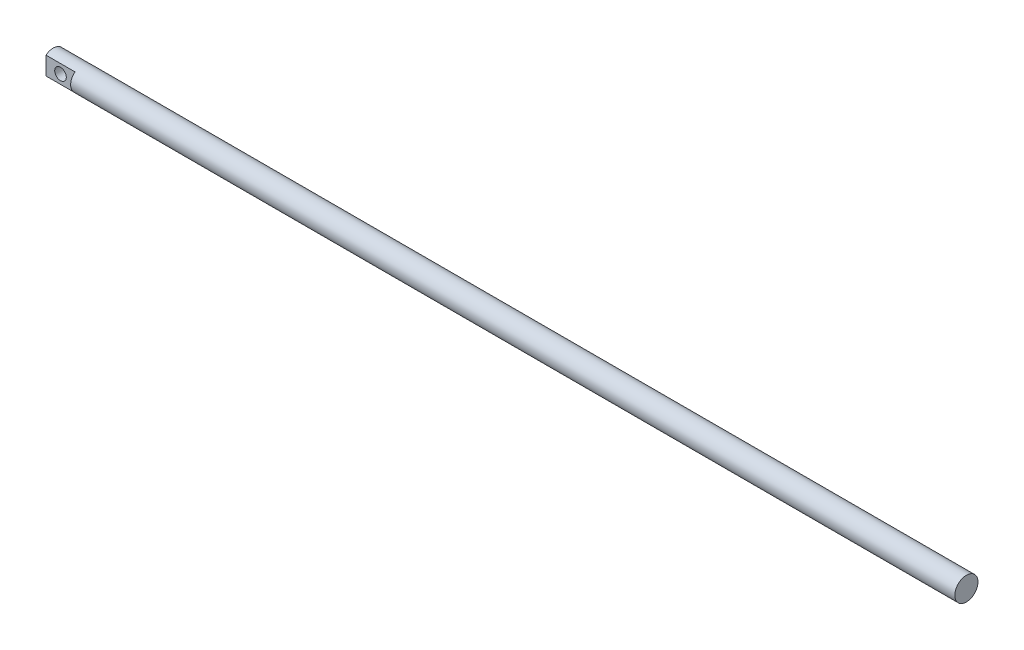
ISO-10303-21;
HEADER;
FILE_DESCRIPTION(('STEP AP214'),'2;1');
FILE_NAME('part.step','',(''),(''),'','','');
FILE_SCHEMA(('AUTOMOTIVE_DESIGN { 1 0 10303 214 1 1 1 1 }'));
ENDSEC;
DATA;
#1=APPLICATION_CONTEXT('core data for automotive mechanical design processes');
#2=APPLICATION_PROTOCOL_DEFINITION('international standard','automotive_design',2000,#1);
#3=PRODUCT_CONTEXT('',#1,'mechanical');
#4=PRODUCT('Part','Part','',(#3));
#5=PRODUCT_RELATED_PRODUCT_CATEGORY('part','',(#4));
#6=PRODUCT_DEFINITION_FORMATION('','',#4);
#7=PRODUCT_DEFINITION_CONTEXT('part definition',#1,'design');
#8=PRODUCT_DEFINITION('design','',#6,#7);
#9=PRODUCT_DEFINITION_SHAPE('','',#8);
#10=(LENGTH_UNIT() NAMED_UNIT(*) SI_UNIT(.MILLI.,.METRE.));
#11=(NAMED_UNIT(*) PLANE_ANGLE_UNIT() SI_UNIT($,.RADIAN.));
#12=(NAMED_UNIT(*) SI_UNIT($,.STERADIAN.) SOLID_ANGLE_UNIT());
#13=UNCERTAINTY_MEASURE_WITH_UNIT(LENGTH_MEASURE(1.E-05),#10,'distance_accuracy_value','');
#14=(GEOMETRIC_REPRESENTATION_CONTEXT(3) GLOBAL_UNCERTAINTY_ASSIGNED_CONTEXT((#13)) GLOBAL_UNIT_ASSIGNED_CONTEXT((#10,
#11,#12)) REPRESENTATION_CONTEXT('',''));
#15=CARTESIAN_POINT('',(0.,0.,0.));
#16=DIRECTION('',(0.,0.,1.));
#17=DIRECTION('',(1.,0.,0.));
#18=AXIS2_PLACEMENT_3D('',#15,#16,#17);
#19=CARTESIAN_POINT('',(630.,0.,0.));
#20=DIRECTION('',(-1.,0.,0.));
#21=DIRECTION('',(0.,0.,1.));
#22=AXIS2_PLACEMENT_3D('',#19,#20,#21);
#23=CYLINDRICAL_SURFACE('',#22,8.);
#24=CARTESIAN_POINT('',(630.,0.,0.));
#25=DIRECTION('',(1.,0.,0.));
#26=DIRECTION('',(0.,0.,-1.));
#27=AXIS2_PLACEMENT_3D('',#24,#25,#26);
#28=CIRCLE('',#27,8.);
#29=CARTESIAN_POINT('',(630.,0.,-8.));
#30=VERTEX_POINT('',#29);
#31=EDGE_CURVE('E85',#30,#30,#28,.T.);
#32=ORIENTED_EDGE('',*,*,#31,.F.);
#33=EDGE_LOOP('',(#32));
#34=FACE_BOUND('',#33,.T.);
#35=DIRECTION('',(-1.,0.,0.));
#36=VECTOR('',#35,1.);
#37=CARTESIAN_POINT('',(630.,6.2449979983984,5.));
#38=LINE('',#37,#36);
#39=CARTESIAN_POINT('',(20.,6.2449979983984,5.));
#40=VERTEX_POINT('',#39);
#41=CARTESIAN_POINT('',(0.,6.2449979983984,5.));
#42=VERTEX_POINT('',#41);
#43=EDGE_CURVE('E59',#40,#42,#38,.T.);
#44=ORIENTED_EDGE('',*,*,#43,.F.);
#45=CARTESIAN_POINT('',(20.,0.,0.));
#46=DIRECTION('',(-1.,0.,0.));
#47=DIRECTION('',(0.,0.,1.));
#48=AXIS2_PLACEMENT_3D('',#45,#46,#47);
#49=CIRCLE('',#48,8.);
#50=CARTESIAN_POINT('',(20.,-6.2449979983984,5.));
#51=VERTEX_POINT('',#50);
#52=EDGE_CURVE('E12',#51,#40,#49,.T.);
#53=ORIENTED_EDGE('',*,*,#52,.F.);
#54=DIRECTION('',(-1.,0.,0.));
#55=VECTOR('',#54,1.);
#56=CARTESIAN_POINT('',(630.,-6.2449979983984,5.));
#57=LINE('',#56,#55);
#58=CARTESIAN_POINT('',(0.,-6.2449979983984,5.));
#59=VERTEX_POINT('',#58);
#60=EDGE_CURVE('E105',#59,#51,#57,.F.);
#61=ORIENTED_EDGE('',*,*,#60,.F.);
#62=CARTESIAN_POINT('',(0.,0.,0.));
#63=DIRECTION('',(1.,0.,0.));
#64=DIRECTION('',(0.,0.,-1.));
#65=AXIS2_PLACEMENT_3D('',#62,#63,#64);
#66=CIRCLE('',#65,8.);
#67=CARTESIAN_POINT('',(0.,-6.2449979983984,-5.));
#68=VERTEX_POINT('',#67);
#69=EDGE_CURVE('E94',#59,#68,#66,.T.);
#70=ORIENTED_EDGE('',*,*,#69,.T.);
#71=DIRECTION('',(-1.,0.,0.));
#72=VECTOR('',#71,1.);
#73=CARTESIAN_POINT('',(630.,-6.2449979983984,-5.));
#74=LINE('',#73,#72);
#75=CARTESIAN_POINT('',(20.,-6.2449979983984,-5.));
#76=VERTEX_POINT('',#75);
#77=EDGE_CURVE('E51',#76,#68,#74,.T.);
#78=ORIENTED_EDGE('',*,*,#77,.F.);
#79=CARTESIAN_POINT('',(20.,6.2449979983984,-5.));
#80=VERTEX_POINT('',#79);
#81=EDGE_CURVE('E44',#80,#76,#49,.T.);
#82=ORIENTED_EDGE('',*,*,#81,.F.);
#83=DIRECTION('',(-1.,0.,0.));
#84=VECTOR('',#83,1.);
#85=CARTESIAN_POINT('',(630.,6.2449979983984,-5.));
#86=LINE('',#85,#84);
#87=CARTESIAN_POINT('',(0.,6.2449979983984,-5.));
#88=VERTEX_POINT('',#87);
#89=EDGE_CURVE('E78',#88,#80,#86,.F.);
#90=ORIENTED_EDGE('',*,*,#89,.F.);
#91=EDGE_CURVE('E90',#88,#42,#66,.T.);
#92=ORIENTED_EDGE('',*,*,#91,.T.);
#93=EDGE_LOOP('',(#44,#53,#61,#70,#78,#82,#90,#92));
#94=FACE_BOUND('',#93,.T.);
#95=ADVANCED_FACE('F36',(#34,#94),#23,.T.);
#96=CARTESIAN_POINT('',(0.,0.,0.));
#97=DIRECTION('',(1.,0.,0.));
#98=DIRECTION('',(0.,0.,-1.));
#99=AXIS2_PLACEMENT_3D('',#96,#97,#98);
#100=PLANE('',#99);
#101=DIRECTION('',(0.,-1.,0.));
#102=VECTOR('',#101,1.);
#103=CARTESIAN_POINT('',(0.,0.,5.));
#104=LINE('',#103,#102);
#105=EDGE_CURVE('E84',#42,#59,#104,.T.);
#106=ORIENTED_EDGE('',*,*,#105,.F.);
#107=ORIENTED_EDGE('',*,*,#91,.F.);
#108=DIRECTION('',(0.,1.,0.));
#109=VECTOR('',#108,1.);
#110=CARTESIAN_POINT('',(0.,0.,-5.));
#111=LINE('',#110,#109);
#112=EDGE_CURVE('E75',#68,#88,#111,.T.);
#113=ORIENTED_EDGE('',*,*,#112,.F.);
#114=ORIENTED_EDGE('',*,*,#69,.F.);
#115=EDGE_LOOP('',(#106,#107,#113,#114));
#116=FACE_BOUND('',#115,.T.);
#117=ADVANCED_FACE('F93',(#116),#100,.F.);
#118=CARTESIAN_POINT('',(630.,0.,0.));
#119=DIRECTION('',(1.,0.,0.));
#120=DIRECTION('',(0.,0.,-1.));
#121=AXIS2_PLACEMENT_3D('',#118,#119,#120);
#122=PLANE('',#121);
#123=ORIENTED_EDGE('',*,*,#31,.T.);
#124=EDGE_LOOP('',(#123));
#125=FACE_BOUND('',#124,.T.);
#126=ADVANCED_FACE('F136',(#125),#122,.T.);
#127=CARTESIAN_POINT('',(20.,10.,-5.));
#128=DIRECTION('',(0.,0.,-1.));
#129=DIRECTION('',(0.,1.,0.));
#130=AXIS2_PLACEMENT_3D('',#127,#128,#129);
#131=PLANE('',#130);
#132=CARTESIAN_POINT('',(10.,0.,-5.));
#133=DIRECTION('',(0.,0.,-1.));
#134=DIRECTION('',(0.,1.,0.));
#135=AXIS2_PLACEMENT_3D('',#132,#133,#134);
#136=CIRCLE('',#135,4.);
#137=CARTESIAN_POINT('',(10.,4.,-5.));
#138=VERTEX_POINT('',#137);
#139=EDGE_CURVE('E110',#138,#138,#136,.T.);
#140=ORIENTED_EDGE('',*,*,#139,.F.);
#141=EDGE_LOOP('',(#140));
#142=FACE_BOUND('',#141,.T.);
#143=ORIENTED_EDGE('',*,*,#77,.T.);
#144=ORIENTED_EDGE('',*,*,#112,.T.);
#145=ORIENTED_EDGE('',*,*,#89,.T.);
#146=DIRECTION('',(0.,-1.,0.));
#147=VECTOR('',#146,1.);
#148=CARTESIAN_POINT('',(20.,10.,-5.));
#149=LINE('',#148,#147);
#150=EDGE_CURVE('E91',#80,#76,#149,.T.);
#151=ORIENTED_EDGE('',*,*,#150,.T.);
#152=EDGE_LOOP('',(#143,#144,#145,#151));
#153=FACE_BOUND('',#152,.T.);
#154=ADVANCED_FACE('F77',(#142,#153),#131,.T.);
#155=CARTESIAN_POINT('',(20.,0.,0.));
#156=DIRECTION('',(-1.,0.,0.));
#157=DIRECTION('',(0.,0.,1.));
#158=AXIS2_PLACEMENT_3D('',#155,#156,#157);
#159=PLANE('',#158);
#160=ORIENTED_EDGE('',*,*,#81,.T.);
#161=ORIENTED_EDGE('',*,*,#150,.F.);
#162=EDGE_LOOP('',(#160,#161));
#163=FACE_BOUND('',#162,.T.);
#164=ADVANCED_FACE('F101',(#163),#159,.T.);
#165=ORIENTED_EDGE('',*,*,#52,.T.);
#166=DIRECTION('',(0.,1.,0.));
#167=VECTOR('',#166,1.);
#168=CARTESIAN_POINT('',(20.,10.,5.));
#169=LINE('',#168,#167);
#170=EDGE_CURVE('E102',#51,#40,#169,.T.);
#171=ORIENTED_EDGE('',*,*,#170,.F.);
#172=EDGE_LOOP('',(#165,#171));
#173=FACE_BOUND('',#172,.T.);
#174=ADVANCED_FACE('F121',(#173),#159,.T.);
#175=CARTESIAN_POINT('',(20.,10.,5.));
#176=DIRECTION('',(0.,0.,1.));
#177=DIRECTION('',(0.,-1.,0.));
#178=AXIS2_PLACEMENT_3D('',#175,#176,#177);
#179=PLANE('',#178);
#180=CARTESIAN_POINT('',(10.,0.,5.));
#181=DIRECTION('',(0.,0.,1.));
#182=DIRECTION('',(0.,-1.,0.));
#183=AXIS2_PLACEMENT_3D('',#180,#181,#182);
#184=CIRCLE('',#183,4.);
#185=CARTESIAN_POINT('',(10.,-4.,5.));
#186=VERTEX_POINT('',#185);
#187=EDGE_CURVE('E39',#186,#186,#184,.T.);
#188=ORIENTED_EDGE('',*,*,#187,.F.);
#189=EDGE_LOOP('',(#188));
#190=FACE_BOUND('',#189,.T.);
#191=ORIENTED_EDGE('',*,*,#43,.T.);
#192=ORIENTED_EDGE('',*,*,#105,.T.);
#193=ORIENTED_EDGE('',*,*,#60,.T.);
#194=ORIENTED_EDGE('',*,*,#170,.T.);
#195=EDGE_LOOP('',(#191,#192,#193,#194));
#196=FACE_BOUND('',#195,.T.);
#197=ADVANCED_FACE('F119',(#190,#196),#179,.T.);
#198=CARTESIAN_POINT('',(10.,0.,15.));
#199=DIRECTION('',(0.,0.,-1.));
#200=DIRECTION('',(0.,1.,0.));
#201=AXIS2_PLACEMENT_3D('',#198,#199,#200);
#202=CYLINDRICAL_SURFACE('',#201,4.);
#203=ORIENTED_EDGE('',*,*,#187,.T.);
#204=EDGE_LOOP('',(#203));
#205=FACE_BOUND('',#204,.T.);
#206=ORIENTED_EDGE('',*,*,#139,.T.);
#207=EDGE_LOOP('',(#206));
#208=FACE_BOUND('',#207,.T.);
#209=ADVANCED_FACE('F117',(#205,#208),#202,.F.);
#210=CLOSED_SHELL('',(#95,#117,#126,#154,#164,#174,#197,#209));
#211=MANIFOLD_SOLID_BREP('B2',#210);
#212=ADVANCED_BREP_SHAPE_REPRESENTATION('',(#18,#211),#14);
#213=SHAPE_DEFINITION_REPRESENTATION(#9,#212);
ENDSEC;
END-ISO-10303-21;
